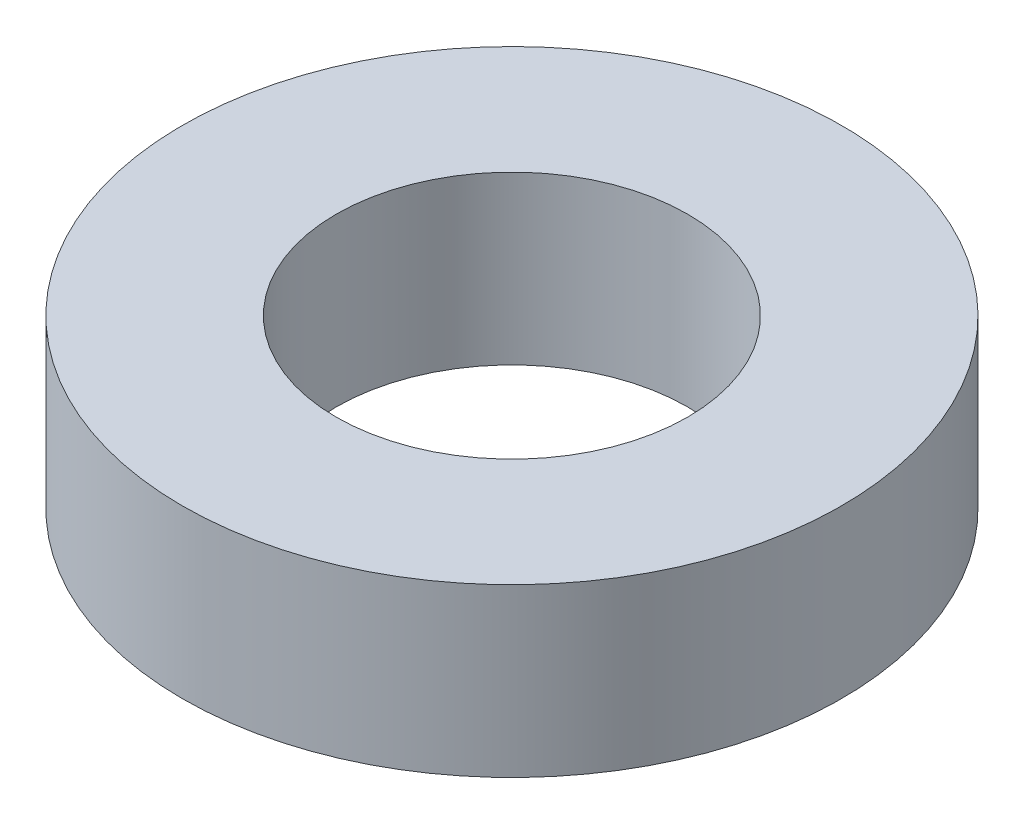
ISO-10303-21;
HEADER;
FILE_DESCRIPTION(('STEP AP214'),'2;1');
FILE_NAME('part.step','',(''),(''),'','','');
FILE_SCHEMA(('AUTOMOTIVE_DESIGN { 1 0 10303 214 1 1 1 1 }'));
ENDSEC;
DATA;
#1=APPLICATION_CONTEXT('core data for automotive mechanical design processes');
#2=APPLICATION_PROTOCOL_DEFINITION('international standard','automotive_design',2000,#1);
#3=PRODUCT_CONTEXT('',#1,'mechanical');
#4=PRODUCT('Part','Part','',(#3));
#5=PRODUCT_RELATED_PRODUCT_CATEGORY('part','',(#4));
#6=PRODUCT_DEFINITION_FORMATION('','',#4);
#7=PRODUCT_DEFINITION_CONTEXT('part definition',#1,'design');
#8=PRODUCT_DEFINITION('design','',#6,#7);
#9=PRODUCT_DEFINITION_SHAPE('','',#8);
#10=(LENGTH_UNIT() NAMED_UNIT(*) SI_UNIT(.MILLI.,.METRE.));
#11=(NAMED_UNIT(*) PLANE_ANGLE_UNIT() SI_UNIT($,.RADIAN.));
#12=(NAMED_UNIT(*) SI_UNIT($,.STERADIAN.) SOLID_ANGLE_UNIT());
#13=UNCERTAINTY_MEASURE_WITH_UNIT(LENGTH_MEASURE(1.E-05),#10,'distance_accuracy_value','');
#14=(GEOMETRIC_REPRESENTATION_CONTEXT(3) GLOBAL_UNCERTAINTY_ASSIGNED_CONTEXT((#13)) GLOBAL_UNIT_ASSIGNED_CONTEXT((#10,
#11,#12)) REPRESENTATION_CONTEXT('',''));
#15=CARTESIAN_POINT('',(0.,0.,0.));
#16=DIRECTION('',(0.,0.,1.));
#17=DIRECTION('',(1.,0.,0.));
#18=AXIS2_PLACEMENT_3D('',#15,#16,#17);
#19=CARTESIAN_POINT('',(0.,19.,0.));
#20=DIRECTION('',(0.,-1.,0.));
#21=DIRECTION('',(0.,0.,-1.));
#22=AXIS2_PLACEMENT_3D('',#19,#20,#21);
#23=CYLINDRICAL_SURFACE('',#22,37.5);
#24=CARTESIAN_POINT('',(0.,19.,0.));
#25=DIRECTION('',(0.,1.,0.));
#26=DIRECTION('',(0.,0.,1.));
#27=AXIS2_PLACEMENT_3D('',#24,#25,#26);
#28=CIRCLE('',#27,37.5);
#29=CARTESIAN_POINT('',(0.,19.,37.5));
#30=VERTEX_POINT('',#29);
#31=EDGE_CURVE('E10',#30,#30,#28,.T.);
#32=ORIENTED_EDGE('',*,*,#31,.F.);
#33=EDGE_LOOP('',(#32));
#34=FACE_BOUND('',#33,.T.);
#35=CARTESIAN_POINT('',(0.,0.,0.));
#36=DIRECTION('',(0.,1.,0.));
#37=DIRECTION('',(0.,0.,1.));
#38=AXIS2_PLACEMENT_3D('',#35,#36,#37);
#39=CIRCLE('',#38,37.5);
#40=CARTESIAN_POINT('',(0.,0.,37.5));
#41=VERTEX_POINT('',#40);
#42=EDGE_CURVE('E37',#41,#41,#39,.T.);
#43=ORIENTED_EDGE('',*,*,#42,.T.);
#44=EDGE_LOOP('',(#43));
#45=FACE_BOUND('',#44,.T.);
#46=ADVANCED_FACE('F40',(#34,#45),#23,.T.);
#47=CARTESIAN_POINT('',(0.,19.,0.));
#48=DIRECTION('',(0.,1.,0.));
#49=DIRECTION('',(0.,0.,1.));
#50=AXIS2_PLACEMENT_3D('',#47,#48,#49);
#51=PLANE('',#50);
#52=CARTESIAN_POINT('',(0.,19.,0.));
#53=DIRECTION('',(0.,1.,0.));
#54=DIRECTION('',(0.,0.,1.));
#55=AXIS2_PLACEMENT_3D('',#52,#53,#54);
#56=CIRCLE('',#55,20.);
#57=CARTESIAN_POINT('',(0.,19.,20.));
#58=VERTEX_POINT('',#57);
#59=EDGE_CURVE('E50',#58,#58,#56,.T.);
#60=ORIENTED_EDGE('',*,*,#59,.F.);
#61=EDGE_LOOP('',(#60));
#62=FACE_BOUND('',#61,.T.);
#63=ORIENTED_EDGE('',*,*,#31,.T.);
#64=EDGE_LOOP('',(#63));
#65=FACE_BOUND('',#64,.T.);
#66=ADVANCED_FACE('F59',(#62,#65),#51,.T.);
#67=CARTESIAN_POINT('',(0.,0.,0.));
#68=DIRECTION('',(0.,1.,0.));
#69=DIRECTION('',(0.,0.,1.));
#70=AXIS2_PLACEMENT_3D('',#67,#68,#69);
#71=PLANE('',#70);
#72=CARTESIAN_POINT('',(0.,0.,0.));
#73=DIRECTION('',(0.,1.,0.));
#74=DIRECTION('',(0.,0.,1.));
#75=AXIS2_PLACEMENT_3D('',#72,#73,#74);
#76=CIRCLE('',#75,20.);
#77=CARTESIAN_POINT('',(0.,0.,20.));
#78=VERTEX_POINT('',#77);
#79=EDGE_CURVE('E47',#78,#78,#76,.T.);
#80=ORIENTED_EDGE('',*,*,#79,.T.);
#81=EDGE_LOOP('',(#80));
#82=FACE_BOUND('',#81,.T.);
#83=ORIENTED_EDGE('',*,*,#42,.F.);
#84=EDGE_LOOP('',(#83));
#85=FACE_BOUND('',#84,.T.);
#86=ADVANCED_FACE('F58',(#82,#85),#71,.F.);
#87=CARTESIAN_POINT('',(0.,19.,0.));
#88=DIRECTION('',(0.,-1.,0.));
#89=DIRECTION('',(0.,0.,-1.));
#90=AXIS2_PLACEMENT_3D('',#87,#88,#89);
#91=CYLINDRICAL_SURFACE('',#90,20.);
#92=ORIENTED_EDGE('',*,*,#59,.T.);
#93=EDGE_LOOP('',(#92));
#94=FACE_BOUND('',#93,.T.);
#95=ORIENTED_EDGE('',*,*,#79,.F.);
#96=EDGE_LOOP('',(#95));
#97=FACE_BOUND('',#96,.T.);
#98=ADVANCED_FACE('F54',(#94,#97),#91,.F.);
#99=CLOSED_SHELL('',(#46,#66,#86,#98));
#100=MANIFOLD_SOLID_BREP('B2',#99);
#101=ADVANCED_BREP_SHAPE_REPRESENTATION('',(#18,#100),#14);
#102=SHAPE_DEFINITION_REPRESENTATION(#9,#101);
ENDSEC;
END-ISO-10303-21;
